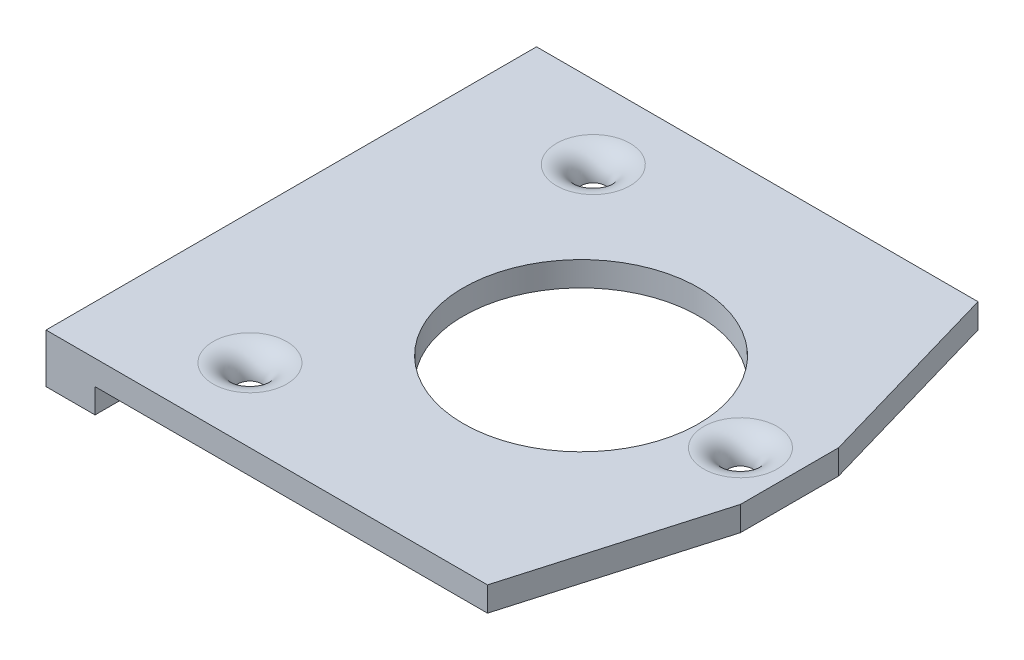
ISO-10303-21;
HEADER;
FILE_DESCRIPTION(('STEP AP214'),'2;1');
FILE_NAME('part.step','',(''),(''),'','','');
FILE_SCHEMA(('AUTOMOTIVE_DESIGN { 1 0 10303 214 1 1 1 1 }'));
ENDSEC;
DATA;
#1=APPLICATION_CONTEXT('core data for automotive mechanical design processes');
#2=APPLICATION_PROTOCOL_DEFINITION('international standard','automotive_design',2000,#1);
#3=PRODUCT_CONTEXT('',#1,'mechanical');
#4=PRODUCT('Part','Part','',(#3));
#5=PRODUCT_RELATED_PRODUCT_CATEGORY('part','',(#4));
#6=PRODUCT_DEFINITION_FORMATION('','',#4);
#7=PRODUCT_DEFINITION_CONTEXT('part definition',#1,'design');
#8=PRODUCT_DEFINITION('design','',#6,#7);
#9=PRODUCT_DEFINITION_SHAPE('','',#8);
#10=(LENGTH_UNIT() NAMED_UNIT(*) SI_UNIT(.MILLI.,.METRE.));
#11=(NAMED_UNIT(*) PLANE_ANGLE_UNIT() SI_UNIT($,.RADIAN.));
#12=(NAMED_UNIT(*) SI_UNIT($,.STERADIAN.) SOLID_ANGLE_UNIT());
#13=UNCERTAINTY_MEASURE_WITH_UNIT(LENGTH_MEASURE(1.E-05),#10,'distance_accuracy_value','');
#14=(GEOMETRIC_REPRESENTATION_CONTEXT(3) GLOBAL_UNCERTAINTY_ASSIGNED_CONTEXT((#13)) GLOBAL_UNIT_ASSIGNED_CONTEXT((#10,
#11,#12)) REPRESENTATION_CONTEXT('',''));
#15=CARTESIAN_POINT('',(0.,0.,0.));
#16=DIRECTION('',(0.,0.,1.));
#17=DIRECTION('',(1.,0.,0.));
#18=AXIS2_PLACEMENT_3D('',#15,#16,#17);
#19=CARTESIAN_POINT('',(0.,3.175,0.));
#20=DIRECTION('',(0.,-1.,0.));
#21=DIRECTION('',(0.,0.,-1.));
#22=AXIS2_PLACEMENT_3D('',#19,#20,#21);
#23=PLANE('',#22);
#24=CARTESIAN_POINT('',(10.525,3.175,22.225));
#25=DIRECTION('',(0.,-1.,0.));
#26=DIRECTION('',(0.,0.,-1.));
#27=AXIS2_PLACEMENT_3D('',#24,#25,#26);
#28=CIRCLE('',#27,4.7625);
#29=CARTESIAN_POINT('',(10.525,3.175,17.4625));
#30=VERTEX_POINT('',#29);
#31=EDGE_CURVE('E11',#30,#30,#28,.T.);
#32=ORIENTED_EDGE('',*,*,#31,.T.);
#33=EDGE_LOOP('',(#32));
#34=FACE_BOUND('',#33,.T.);
#35=CARTESIAN_POINT('',(51.8,3.175,0.));
#36=DIRECTION('',(0.,-1.,0.));
#37=DIRECTION('',(0.,0.,-1.));
#38=AXIS2_PLACEMENT_3D('',#35,#36,#37);
#39=CIRCLE('',#38,4.7625);
#40=CARTESIAN_POINT('',(51.8,3.175,-4.76250000000001));
#41=VERTEX_POINT('',#40);
#42=EDGE_CURVE('E42',#41,#41,#39,.T.);
#43=ORIENTED_EDGE('',*,*,#42,.T.);
#44=EDGE_LOOP('',(#43));
#45=FACE_BOUND('',#44,.T.);
#46=CARTESIAN_POINT('',(10.525,3.175,-22.225));
#47=DIRECTION('',(0.,-1.,0.));
#48=DIRECTION('',(0.,0.,-1.));
#49=AXIS2_PLACEMENT_3D('',#46,#47,#48);
#50=CIRCLE('',#49,4.7625);
#51=CARTESIAN_POINT('',(10.525,3.175,-26.9875));
#52=VERTEX_POINT('',#51);
#53=EDGE_CURVE('E180',#52,#52,#50,.T.);
#54=ORIENTED_EDGE('',*,*,#53,.T.);
#55=EDGE_LOOP('',(#54));
#56=FACE_BOUND('',#55,.T.);
#57=DIRECTION('',(-1.,0.,0.));
#58=VECTOR('',#57,1.);
#59=CARTESIAN_POINT('',(0.,3.175,-31.75));
#60=LINE('',#59,#58);
#61=CARTESIAN_POINT('',(50.8,3.175,-31.75));
#62=VERTEX_POINT('',#61);
#63=CARTESIAN_POINT('',(-6.35000000000001,3.175,-31.75));
#64=VERTEX_POINT('',#63);
#65=EDGE_CURVE('E153',#62,#64,#60,.T.);
#66=ORIENTED_EDGE('',*,*,#65,.T.);
#67=DIRECTION('',(0.,0.,-1.));
#68=VECTOR('',#67,1.);
#69=CARTESIAN_POINT('',(-6.35000000000001,3.175,-31.75));
#70=LINE('',#69,#68);
#71=CARTESIAN_POINT('',(-6.34999999999999,3.175,31.75));
#72=VERTEX_POINT('',#71);
#73=EDGE_CURVE('E123',#72,#64,#70,.T.);
#74=ORIENTED_EDGE('',*,*,#73,.F.);
#75=DIRECTION('',(1.,0.,0.));
#76=VECTOR('',#75,1.);
#77=CARTESIAN_POINT('',(0.,3.175,31.75));
#78=LINE('',#77,#76);
#79=CARTESIAN_POINT('',(50.8,3.175,31.7499999999999));
#80=VERTEX_POINT('',#79);
#81=EDGE_CURVE('E84',#72,#80,#78,.T.);
#82=ORIENTED_EDGE('',*,*,#81,.T.);
#83=DIRECTION('',(0.277966247512723,0.,-0.96059084174465));
#84=VECTOR('',#83,1.);
#85=CARTESIAN_POINT('',(50.8,3.175,31.7499999999999));
#86=LINE('',#85,#84);
#87=CARTESIAN_POINT('',(58.15,3.175,6.34999999999999));
#88=VERTEX_POINT('',#87);
#89=EDGE_CURVE('E156',#80,#88,#86,.T.);
#90=ORIENTED_EDGE('',*,*,#89,.T.);
#91=DIRECTION('',(0.,0.,-1.));
#92=VECTOR('',#91,1.);
#93=CARTESIAN_POINT('',(58.15,3.175,-6.35000000000001));
#94=LINE('',#93,#92);
#95=CARTESIAN_POINT('',(58.15,3.175,-6.35000000000001));
#96=VERTEX_POINT('',#95);
#97=EDGE_CURVE('E158',#88,#96,#94,.T.);
#98=ORIENTED_EDGE('',*,*,#97,.T.);
#99=DIRECTION('',(-0.277966247512724,0.,-0.96059084174465));
#100=VECTOR('',#99,1.);
#101=CARTESIAN_POINT('',(58.15,3.175,-6.35000000000001));
#102=LINE('',#101,#100);
#103=EDGE_CURVE('E50',#96,#62,#102,.T.);
#104=ORIENTED_EDGE('',*,*,#103,.T.);
#105=EDGE_LOOP('',(#66,#74,#82,#90,#98,#104));
#106=FACE_BOUND('',#105,.T.);
#107=CARTESIAN_POINT('',(31.1625,3.175,0.));
#108=DIRECTION('',(0.,1.,0.));
#109=DIRECTION('',(0.,0.,1.));
#110=AXIS2_PLACEMENT_3D('',#107,#108,#109);
#111=CIRCLE('',#110,15.24);
#112=CARTESIAN_POINT('',(31.1625,3.175,15.24));
#113=VERTEX_POINT('',#112);
#114=EDGE_CURVE('E136',#113,#113,#111,.T.);
#115=ORIENTED_EDGE('',*,*,#114,.F.);
#116=EDGE_LOOP('',(#115));
#117=FACE_BOUND('',#116,.T.);
#118=ADVANCED_FACE('F33',(#34,#45,#56,#106,#117),#23,.F.);
#119=CARTESIAN_POINT('',(0.,0.,0.));
#120=DIRECTION('',(0.,-1.,0.));
#121=DIRECTION('',(0.,0.,-1.));
#122=AXIS2_PLACEMENT_3D('',#119,#120,#121);
#123=PLANE('',#122);
#124=CARTESIAN_POINT('',(51.8,0.,0.));
#125=DIRECTION('',(0.,1.,0.));
#126=DIRECTION('',(0.,0.,1.));
#127=AXIS2_PLACEMENT_3D('',#124,#125,#126);
#128=CIRCLE('',#127,1.5875);
#129=CARTESIAN_POINT('',(51.8,0.,1.58749999999999));
#130=VERTEX_POINT('',#129);
#131=EDGE_CURVE('E142',#130,#130,#128,.T.);
#132=ORIENTED_EDGE('',*,*,#131,.T.);
#133=EDGE_LOOP('',(#132));
#134=FACE_BOUND('',#133,.T.);
#135=CARTESIAN_POINT('',(10.525,0.,-22.225));
#136=DIRECTION('',(0.,1.,0.));
#137=DIRECTION('',(0.,0.,1.));
#138=AXIS2_PLACEMENT_3D('',#135,#136,#137);
#139=CIRCLE('',#138,1.5875);
#140=CARTESIAN_POINT('',(10.525,0.,-20.6375));
#141=VERTEX_POINT('',#140);
#142=EDGE_CURVE('E149',#141,#141,#139,.T.);
#143=ORIENTED_EDGE('',*,*,#142,.T.);
#144=EDGE_LOOP('',(#143));
#145=FACE_BOUND('',#144,.T.);
#146=DIRECTION('',(-1.,0.,0.));
#147=VECTOR('',#146,1.);
#148=CARTESIAN_POINT('',(0.,0.,-31.75));
#149=LINE('',#148,#147);
#150=CARTESIAN_POINT('',(50.8,0.,-31.75));
#151=VERTEX_POINT('',#150);
#152=CARTESIAN_POINT('',(0.,0.,-31.75));
#153=VERTEX_POINT('',#152);
#154=EDGE_CURVE('E152',#151,#153,#149,.T.);
#155=ORIENTED_EDGE('',*,*,#154,.F.);
#156=DIRECTION('',(-0.277966247512724,0.,-0.96059084174465));
#157=VECTOR('',#156,1.);
#158=CARTESIAN_POINT('',(58.15,0.,-6.35000000000001));
#159=LINE('',#158,#157);
#160=CARTESIAN_POINT('',(58.15,0.,-6.35000000000001));
#161=VERTEX_POINT('',#160);
#162=EDGE_CURVE('E77',#161,#151,#159,.T.);
#163=ORIENTED_EDGE('',*,*,#162,.F.);
#164=DIRECTION('',(0.,0.,-1.));
#165=VECTOR('',#164,1.);
#166=CARTESIAN_POINT('',(58.15,0.,-6.35000000000001));
#167=LINE('',#166,#165);
#168=CARTESIAN_POINT('',(58.15,0.,6.34999999999999));
#169=VERTEX_POINT('',#168);
#170=EDGE_CURVE('E71',#169,#161,#167,.T.);
#171=ORIENTED_EDGE('',*,*,#170,.F.);
#172=DIRECTION('',(0.277966247512723,0.,-0.96059084174465));
#173=VECTOR('',#172,1.);
#174=CARTESIAN_POINT('',(50.8,0.,31.7499999999999));
#175=LINE('',#174,#173);
#176=CARTESIAN_POINT('',(50.8,0.,31.7499999999999));
#177=VERTEX_POINT('',#176);
#178=EDGE_CURVE('E168',#177,#169,#175,.T.);
#179=ORIENTED_EDGE('',*,*,#178,.F.);
#180=DIRECTION('',(1.,0.,0.));
#181=VECTOR('',#180,1.);
#182=CARTESIAN_POINT('',(0.,0.,31.75));
#183=LINE('',#182,#181);
#184=CARTESIAN_POINT('',(0.,0.,31.75));
#185=VERTEX_POINT('',#184);
#186=EDGE_CURVE('E166',#185,#177,#183,.T.);
#187=ORIENTED_EDGE('',*,*,#186,.F.);
#188=DIRECTION('',(0.,0.,1.));
#189=VECTOR('',#188,1.);
#190=CARTESIAN_POINT('',(0.,0.,-31.75));
#191=LINE('',#190,#189);
#192=EDGE_CURVE('E163',#153,#185,#191,.T.);
#193=ORIENTED_EDGE('',*,*,#192,.F.);
#194=EDGE_LOOP('',(#155,#163,#171,#179,#187,#193));
#195=FACE_BOUND('',#194,.T.);
#196=CARTESIAN_POINT('',(10.525,0.,22.225));
#197=DIRECTION('',(0.,1.,0.));
#198=DIRECTION('',(0.,0.,1.));
#199=AXIS2_PLACEMENT_3D('',#196,#197,#198);
#200=CIRCLE('',#199,1.5875);
#201=CARTESIAN_POINT('',(10.525,0.,23.8125));
#202=VERTEX_POINT('',#201);
#203=EDGE_CURVE('E146',#202,#202,#200,.T.);
#204=ORIENTED_EDGE('',*,*,#203,.T.);
#205=EDGE_LOOP('',(#204));
#206=FACE_BOUND('',#205,.T.);
#207=CARTESIAN_POINT('',(31.1625,0.,0.));
#208=DIRECTION('',(0.,1.,0.));
#209=DIRECTION('',(0.,0.,1.));
#210=AXIS2_PLACEMENT_3D('',#207,#208,#209);
#211=CIRCLE('',#210,15.24);
#212=CARTESIAN_POINT('',(31.1625,0.,15.24));
#213=VERTEX_POINT('',#212);
#214=EDGE_CURVE('E133',#213,#213,#211,.T.);
#215=ORIENTED_EDGE('',*,*,#214,.T.);
#216=EDGE_LOOP('',(#215));
#217=FACE_BOUND('',#216,.T.);
#218=ADVANCED_FACE('F193',(#134,#145,#195,#206,#217),#123,.T.);
#219=CARTESIAN_POINT('',(0.,3.175,-31.75));
#220=DIRECTION('',(0.,0.,1.));
#221=DIRECTION('',(1.,0.,0.));
#222=AXIS2_PLACEMENT_3D('',#219,#220,#221);
#223=PLANE('',#222);
#224=ORIENTED_EDGE('',*,*,#154,.T.);
#225=DIRECTION('',(0.,-1.,0.));
#226=VECTOR('',#225,1.);
#227=CARTESIAN_POINT('',(0.,3.175,-31.75));
#228=LINE('',#227,#226);
#229=CARTESIAN_POINT('',(0.,-3.175,-31.75));
#230=VERTEX_POINT('',#229);
#231=EDGE_CURVE('E131',#153,#230,#228,.T.);
#232=ORIENTED_EDGE('',*,*,#231,.T.);
#233=DIRECTION('',(1.,0.,0.));
#234=VECTOR('',#233,1.);
#235=CARTESIAN_POINT('',(-6.35000000000001,-3.175,-31.75));
#236=LINE('',#235,#234);
#237=CARTESIAN_POINT('',(-6.35000000000001,-3.175,-31.75));
#238=VERTEX_POINT('',#237);
#239=EDGE_CURVE('E111',#238,#230,#236,.T.);
#240=ORIENTED_EDGE('',*,*,#239,.F.);
#241=DIRECTION('',(0.,-1.,0.));
#242=VECTOR('',#241,1.);
#243=CARTESIAN_POINT('',(-6.35000000000001,3.175,-31.75));
#244=LINE('',#243,#242);
#245=EDGE_CURVE('E118',#64,#238,#244,.T.);
#246=ORIENTED_EDGE('',*,*,#245,.F.);
#247=ORIENTED_EDGE('',*,*,#65,.F.);
#248=DIRECTION('',(0.,-1.,0.));
#249=VECTOR('',#248,1.);
#250=CARTESIAN_POINT('',(50.8,3.175,-31.75));
#251=LINE('',#250,#249);
#252=EDGE_CURVE('E161',#62,#151,#251,.T.);
#253=ORIENTED_EDGE('',*,*,#252,.T.);
#254=EDGE_LOOP('',(#224,#232,#240,#246,#247,#253));
#255=FACE_BOUND('',#254,.T.);
#256=ADVANCED_FACE('F129',(#255),#223,.F.);
#257=CARTESIAN_POINT('',(0.,3.175,31.75));
#258=DIRECTION('',(0.,0.,-1.));
#259=DIRECTION('',(-1.,0.,0.));
#260=AXIS2_PLACEMENT_3D('',#257,#258,#259);
#261=PLANE('',#260);
#262=ORIENTED_EDGE('',*,*,#186,.T.);
#263=DIRECTION('',(0.,-1.,0.));
#264=VECTOR('',#263,1.);
#265=CARTESIAN_POINT('',(50.8,3.175,31.7499999999999));
#266=LINE('',#265,#264);
#267=EDGE_CURVE('E177',#80,#177,#266,.T.);
#268=ORIENTED_EDGE('',*,*,#267,.F.);
#269=ORIENTED_EDGE('',*,*,#81,.F.);
#270=DIRECTION('',(0.,1.,0.));
#271=VECTOR('',#270,1.);
#272=CARTESIAN_POINT('',(-6.34999999999999,3.175,31.75));
#273=LINE('',#272,#271);
#274=CARTESIAN_POINT('',(-6.34999999999999,-3.175,31.75));
#275=VERTEX_POINT('',#274);
#276=EDGE_CURVE('E117',#275,#72,#273,.T.);
#277=ORIENTED_EDGE('',*,*,#276,.F.);
#278=DIRECTION('',(1.,0.,0.));
#279=VECTOR('',#278,1.);
#280=CARTESIAN_POINT('',(-6.34999999999999,-3.175,31.75));
#281=LINE('',#280,#279);
#282=CARTESIAN_POINT('',(0.,-3.175,31.75));
#283=VERTEX_POINT('',#282);
#284=EDGE_CURVE('E113',#275,#283,#281,.T.);
#285=ORIENTED_EDGE('',*,*,#284,.T.);
#286=DIRECTION('',(0.,1.,0.));
#287=VECTOR('',#286,1.);
#288=CARTESIAN_POINT('',(0.,3.175,31.75));
#289=LINE('',#288,#287);
#290=EDGE_CURVE('E126',#283,#185,#289,.T.);
#291=ORIENTED_EDGE('',*,*,#290,.T.);
#292=EDGE_LOOP('',(#262,#268,#269,#277,#285,#291));
#293=FACE_BOUND('',#292,.T.);
#294=ADVANCED_FACE('F231',(#293),#261,.F.);
#295=CARTESIAN_POINT('',(50.8,3.175,31.7499999999999));
#296=DIRECTION('',(-0.96059084174465,0.,-0.277966247512723));
#297=DIRECTION('',(-0.277966247512724,0.,0.96059084174465));
#298=AXIS2_PLACEMENT_3D('',#295,#296,#297);
#299=PLANE('',#298);
#300=ORIENTED_EDGE('',*,*,#178,.T.);
#301=DIRECTION('',(0.,-1.,0.));
#302=VECTOR('',#301,1.);
#303=CARTESIAN_POINT('',(58.15,3.175,6.34999999999999));
#304=LINE('',#303,#302);
#305=EDGE_CURVE('E175',#88,#169,#304,.T.);
#306=ORIENTED_EDGE('',*,*,#305,.F.);
#307=ORIENTED_EDGE('',*,*,#89,.F.);
#308=ORIENTED_EDGE('',*,*,#267,.T.);
#309=EDGE_LOOP('',(#300,#306,#307,#308));
#310=FACE_BOUND('',#309,.T.);
#311=ADVANCED_FACE('F228',(#310),#299,.F.);
#312=CARTESIAN_POINT('',(58.15,3.175,-6.35000000000001));
#313=DIRECTION('',(-1.,0.,0.));
#314=DIRECTION('',(0.,0.,1.));
#315=AXIS2_PLACEMENT_3D('',#312,#313,#314);
#316=PLANE('',#315);
#317=ORIENTED_EDGE('',*,*,#170,.T.);
#318=DIRECTION('',(0.,-1.,0.));
#319=VECTOR('',#318,1.);
#320=CARTESIAN_POINT('',(58.15,3.175,-6.35000000000001));
#321=LINE('',#320,#319);
#322=EDGE_CURVE('E173',#96,#161,#321,.T.);
#323=ORIENTED_EDGE('',*,*,#322,.F.);
#324=ORIENTED_EDGE('',*,*,#97,.F.);
#325=ORIENTED_EDGE('',*,*,#305,.T.);
#326=EDGE_LOOP('',(#317,#323,#324,#325));
#327=FACE_BOUND('',#326,.T.);
#328=ADVANCED_FACE('F217',(#327),#316,.F.);
#329=CARTESIAN_POINT('',(58.15,3.175,-6.35000000000001));
#330=DIRECTION('',(-0.96059084174465,0.,0.277966247512724));
#331=DIRECTION('',(0.277966247512724,0.,0.96059084174465));
#332=AXIS2_PLACEMENT_3D('',#329,#330,#331);
#333=PLANE('',#332);
#334=ORIENTED_EDGE('',*,*,#162,.T.);
#335=ORIENTED_EDGE('',*,*,#252,.F.);
#336=ORIENTED_EDGE('',*,*,#103,.F.);
#337=ORIENTED_EDGE('',*,*,#322,.T.);
#338=EDGE_LOOP('',(#334,#335,#336,#337));
#339=FACE_BOUND('',#338,.T.);
#340=ADVANCED_FACE('F208',(#339),#333,.F.);
#341=CARTESIAN_POINT('',(31.1625,3.175,0.));
#342=DIRECTION('',(0.,-1.,0.));
#343=DIRECTION('',(0.,0.,-1.));
#344=AXIS2_PLACEMENT_3D('',#341,#342,#343);
#345=CYLINDRICAL_SURFACE('',#344,15.24);
#346=ORIENTED_EDGE('',*,*,#114,.T.);
#347=EDGE_LOOP('',(#346));
#348=FACE_BOUND('',#347,.T.);
#349=ORIENTED_EDGE('',*,*,#214,.F.);
#350=EDGE_LOOP('',(#349));
#351=FACE_BOUND('',#350,.T.);
#352=ADVANCED_FACE('F205',(#348,#351),#345,.F.);
#353=CARTESIAN_POINT('',(0.,0.,0.));
#354=DIRECTION('',(-1.,0.,0.));
#355=DIRECTION('',(0.,0.,1.));
#356=AXIS2_PLACEMENT_3D('',#353,#354,#355);
#357=PLANE('',#356);
#358=ORIENTED_EDGE('',*,*,#231,.F.);
#359=ORIENTED_EDGE('',*,*,#192,.T.);
#360=ORIENTED_EDGE('',*,*,#290,.F.);
#361=DIRECTION('',(0.,0.,1.));
#362=VECTOR('',#361,1.);
#363=CARTESIAN_POINT('',(0.,-3.175,-31.75));
#364=LINE('',#363,#362);
#365=EDGE_CURVE('E342',#230,#283,#364,.T.);
#366=ORIENTED_EDGE('',*,*,#365,.F.);
#367=EDGE_LOOP('',(#358,#359,#360,#366));
#368=FACE_BOUND('',#367,.T.);
#369=ADVANCED_FACE('F207',(#368),#357,.F.);
#370=CARTESIAN_POINT('',(-6.35000000000001,-3.175,-31.75));
#371=DIRECTION('',(0.,1.,0.));
#372=DIRECTION('',(0.,0.,1.));
#373=AXIS2_PLACEMENT_3D('',#370,#371,#372);
#374=PLANE('',#373);
#375=ORIENTED_EDGE('',*,*,#365,.T.);
#376=ORIENTED_EDGE('',*,*,#284,.F.);
#377=DIRECTION('',(0.,0.,1.));
#378=VECTOR('',#377,1.);
#379=CARTESIAN_POINT('',(-6.35000000000001,-3.175,-31.75));
#380=LINE('',#379,#378);
#381=EDGE_CURVE('E107',#238,#275,#380,.T.);
#382=ORIENTED_EDGE('',*,*,#381,.F.);
#383=ORIENTED_EDGE('',*,*,#239,.T.);
#384=EDGE_LOOP('',(#375,#376,#382,#383));
#385=FACE_BOUND('',#384,.T.);
#386=ADVANCED_FACE('F109',(#385),#374,.F.);
#387=CARTESIAN_POINT('',(-6.35,0.,0.));
#388=DIRECTION('',(-1.,0.,0.));
#389=DIRECTION('',(0.,0.,1.));
#390=AXIS2_PLACEMENT_3D('',#387,#388,#389);
#391=PLANE('',#390);
#392=ORIENTED_EDGE('',*,*,#245,.T.);
#393=ORIENTED_EDGE('',*,*,#381,.T.);
#394=ORIENTED_EDGE('',*,*,#276,.T.);
#395=ORIENTED_EDGE('',*,*,#73,.T.);
#396=EDGE_LOOP('',(#392,#393,#394,#395));
#397=FACE_BOUND('',#396,.T.);
#398=ADVANCED_FACE('F122',(#397),#391,.T.);
#399=CARTESIAN_POINT('',(10.525,0.,22.225));
#400=DIRECTION('',(0.,-1.,0.));
#401=DIRECTION('',(0.,0.,-1.));
#402=AXIS2_PLACEMENT_3D('',#399,#400,#401);
#403=TOROIDAL_SURFACE('',#402,4.7625,3.175);
#404=ORIENTED_EDGE('',*,*,#31,.F.);
#405=EDGE_LOOP('',(#404));
#406=FACE_BOUND('',#405,.T.);
#407=ORIENTED_EDGE('',*,*,#203,.F.);
#408=EDGE_LOOP('',(#407));
#409=FACE_BOUND('',#408,.T.);
#410=ADVANCED_FACE('F190',(#406,#409),#403,.T.);
#411=CARTESIAN_POINT('',(51.8,0.,0.));
#412=DIRECTION('',(0.,-1.,0.));
#413=DIRECTION('',(0.,0.,-1.));
#414=AXIS2_PLACEMENT_3D('',#411,#412,#413);
#415=TOROIDAL_SURFACE('',#414,4.7625,3.175);
#416=ORIENTED_EDGE('',*,*,#42,.F.);
#417=EDGE_LOOP('',(#416));
#418=FACE_BOUND('',#417,.T.);
#419=ORIENTED_EDGE('',*,*,#131,.F.);
#420=EDGE_LOOP('',(#419));
#421=FACE_BOUND('',#420,.T.);
#422=ADVANCED_FACE('F187',(#418,#421),#415,.T.);
#423=CARTESIAN_POINT('',(10.525,0.,-22.225));
#424=DIRECTION('',(0.,-1.,0.));
#425=DIRECTION('',(0.,0.,-1.));
#426=AXIS2_PLACEMENT_3D('',#423,#424,#425);
#427=TOROIDAL_SURFACE('',#426,4.7625,3.175);
#428=ORIENTED_EDGE('',*,*,#53,.F.);
#429=EDGE_LOOP('',(#428));
#430=FACE_BOUND('',#429,.T.);
#431=ORIENTED_EDGE('',*,*,#142,.F.);
#432=EDGE_LOOP('',(#431));
#433=FACE_BOUND('',#432,.T.);
#434=ADVANCED_FACE('F35',(#430,#433),#427,.T.);
#435=CLOSED_SHELL('',(#118,#218,#256,#294,#311,#328,#340,#352,#369,#386,#398,#410,#422,#434));
#436=MANIFOLD_SOLID_BREP('B2',#435);
#437=ADVANCED_BREP_SHAPE_REPRESENTATION('',(#18,#436),#14);
#438=SHAPE_DEFINITION_REPRESENTATION(#9,#437);
ENDSEC;
END-ISO-10303-21;
